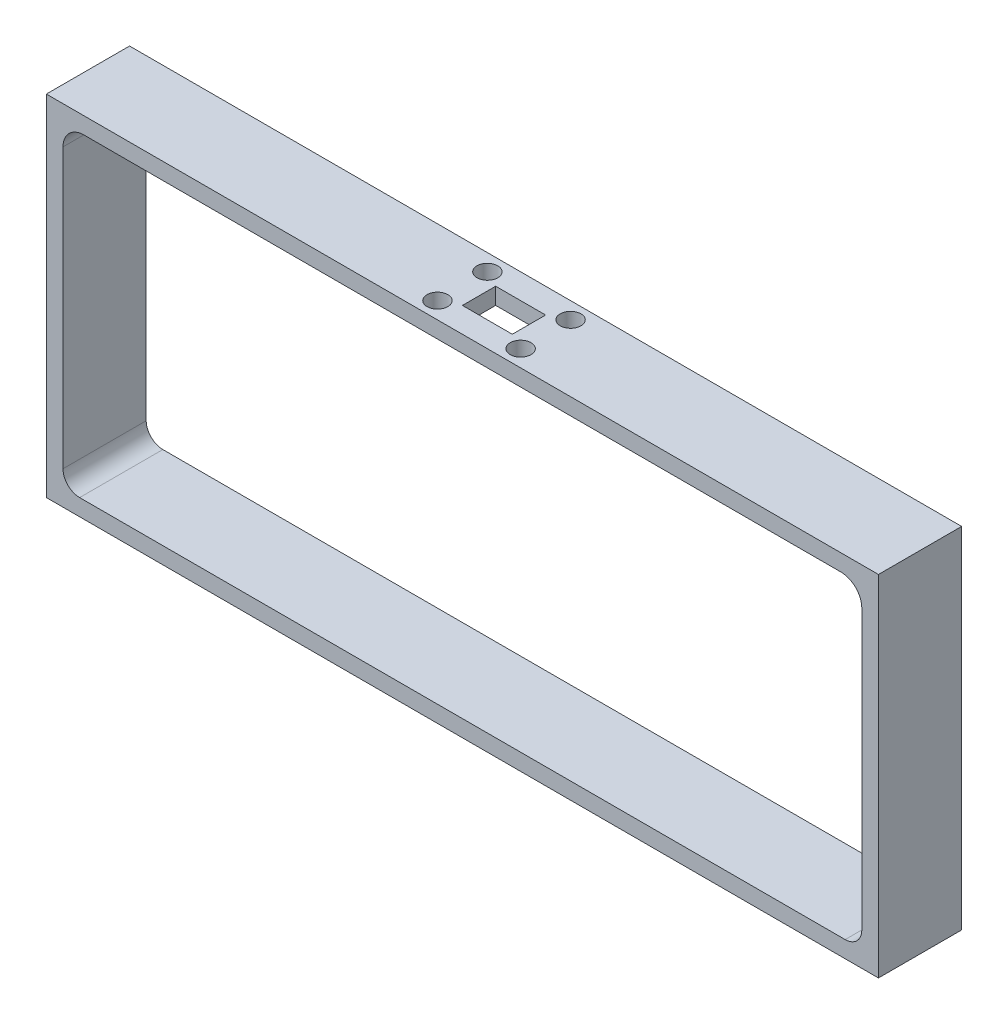
ISO-10303-21;
HEADER;
FILE_DESCRIPTION(('STEP AP214'),'2;1');
FILE_NAME('part.step','',(''),(''),'','','');
FILE_SCHEMA(('AUTOMOTIVE_DESIGN { 1 0 10303 214 1 1 1 1 }'));
ENDSEC;
DATA;
#1=APPLICATION_CONTEXT('core data for automotive mechanical design processes');
#2=APPLICATION_PROTOCOL_DEFINITION('international standard','automotive_design',2000,#1);
#3=PRODUCT_CONTEXT('',#1,'mechanical');
#4=PRODUCT('Part','Part','',(#3));
#5=PRODUCT_RELATED_PRODUCT_CATEGORY('part','',(#4));
#6=PRODUCT_DEFINITION_FORMATION('','',#4);
#7=PRODUCT_DEFINITION_CONTEXT('part definition',#1,'design');
#8=PRODUCT_DEFINITION('design','',#6,#7);
#9=PRODUCT_DEFINITION_SHAPE('','',#8);
#10=(LENGTH_UNIT() NAMED_UNIT(*) SI_UNIT(.MILLI.,.METRE.));
#11=(NAMED_UNIT(*) PLANE_ANGLE_UNIT() SI_UNIT($,.RADIAN.));
#12=(NAMED_UNIT(*) SI_UNIT($,.STERADIAN.) SOLID_ANGLE_UNIT());
#13=UNCERTAINTY_MEASURE_WITH_UNIT(LENGTH_MEASURE(1.E-05),#10,'distance_accuracy_value','');
#14=(GEOMETRIC_REPRESENTATION_CONTEXT(3) GLOBAL_UNCERTAINTY_ASSIGNED_CONTEXT((#13)) GLOBAL_UNIT_ASSIGNED_CONTEXT((#10,
#11,#12)) REPRESENTATION_CONTEXT('',''));
#15=CARTESIAN_POINT('',(0.,0.,0.));
#16=DIRECTION('',(0.,0.,1.));
#17=DIRECTION('',(1.,0.,0.));
#18=AXIS2_PLACEMENT_3D('',#15,#16,#17);
#19=CARTESIAN_POINT('',(-60.96,-50.8,6.35));
#20=DIRECTION('',(-1.,0.,0.));
#21=DIRECTION('',(0.,0.,1.));
#22=AXIS2_PLACEMENT_3D('',#19,#20,#21);
#23=PLANE('',#22);
#24=DIRECTION('',(0.,1.,0.));
#25=VECTOR('',#24,1.);
#26=CARTESIAN_POINT('',(-60.96,-50.8,-6.35));
#27=LINE('',#26,#25);
#28=CARTESIAN_POINT('',(-60.96,-45.72,-6.35));
#29=VERTEX_POINT('',#28);
#30=CARTESIAN_POINT('',(-60.96,-3.175,-6.35));
#31=VERTEX_POINT('',#30);
#32=EDGE_CURVE('E194',#29,#31,#27,.T.);
#33=ORIENTED_EDGE('',*,*,#32,.T.);
#34=DIRECTION('',(0.,0.,1.));
#35=VECTOR('',#34,1.);
#36=CARTESIAN_POINT('',(-60.96,-3.175,6.35));
#37=LINE('',#36,#35);
#38=CARTESIAN_POINT('',(-60.96,-3.175,6.35));
#39=VERTEX_POINT('',#38);
#40=EDGE_CURVE('E292',#31,#39,#37,.T.);
#41=ORIENTED_EDGE('',*,*,#40,.T.);
#42=DIRECTION('',(0.,1.,0.));
#43=VECTOR('',#42,1.);
#44=CARTESIAN_POINT('',(-60.96,-50.8,6.35));
#45=LINE('',#44,#43);
#46=CARTESIAN_POINT('',(-60.96,-45.72,6.35));
#47=VERTEX_POINT('',#46);
#48=EDGE_CURVE('E191',#47,#39,#45,.T.);
#49=ORIENTED_EDGE('',*,*,#48,.F.);
#50=DIRECTION('',(0.,0.,1.));
#51=VECTOR('',#50,1.);
#52=CARTESIAN_POINT('',(-60.96,-45.72,-6.35));
#53=LINE('',#52,#51);
#54=EDGE_CURVE('E275',#47,#29,#53,.F.);
#55=ORIENTED_EDGE('',*,*,#54,.T.);
#56=EDGE_LOOP('',(#33,#41,#49,#55));
#57=FACE_BOUND('',#56,.T.);
#58=ADVANCED_FACE('F37',(#57),#23,.F.);
#59=CARTESIAN_POINT('',(60.96,-50.8,-6.35));
#60=DIRECTION('',(1.,0.,0.));
#61=DIRECTION('',(0.,0.,-1.));
#62=AXIS2_PLACEMENT_3D('',#59,#60,#61);
#63=PLANE('',#62);
#64=DIRECTION('',(0.,1.,0.));
#65=VECTOR('',#64,1.);
#66=CARTESIAN_POINT('',(60.96,-50.8,6.35));
#67=LINE('',#66,#65);
#68=CARTESIAN_POINT('',(60.96,-45.72,6.35));
#69=VERTEX_POINT('',#68);
#70=CARTESIAN_POINT('',(60.96,-3.175,6.35));
#71=VERTEX_POINT('',#70);
#72=EDGE_CURVE('E180',#69,#71,#67,.T.);
#73=ORIENTED_EDGE('',*,*,#72,.T.);
#74=DIRECTION('',(0.,0.,-1.));
#75=VECTOR('',#74,1.);
#76=CARTESIAN_POINT('',(60.96,-3.175,-6.35));
#77=LINE('',#76,#75);
#78=CARTESIAN_POINT('',(60.96,-3.175,-6.35));
#79=VERTEX_POINT('',#78);
#80=EDGE_CURVE('E285',#71,#79,#77,.T.);
#81=ORIENTED_EDGE('',*,*,#80,.T.);
#82=DIRECTION('',(0.,1.,0.));
#83=VECTOR('',#82,1.);
#84=CARTESIAN_POINT('',(60.96,-50.8,-6.35));
#85=LINE('',#84,#83);
#86=CARTESIAN_POINT('',(60.96,-45.72,-6.35));
#87=VERTEX_POINT('',#86);
#88=EDGE_CURVE('E176',#87,#79,#85,.T.);
#89=ORIENTED_EDGE('',*,*,#88,.F.);
#90=DIRECTION('',(0.,0.,-1.));
#91=VECTOR('',#90,1.);
#92=CARTESIAN_POINT('',(60.96,-45.72,6.35));
#93=LINE('',#92,#91);
#94=EDGE_CURVE('E273',#87,#69,#93,.F.);
#95=ORIENTED_EDGE('',*,*,#94,.T.);
#96=EDGE_LOOP('',(#73,#81,#89,#95));
#97=FACE_BOUND('',#96,.T.);
#98=ADVANCED_FACE('F325',(#97),#63,.F.);
#99=CARTESIAN_POINT('',(0.,0.,0.));
#100=DIRECTION('',(0.,-1.,0.));
#101=DIRECTION('',(0.,0.,-1.));
#102=AXIS2_PLACEMENT_3D('',#99,#100,#101);
#103=PLANE('',#102);
#104=CARTESIAN_POINT('',(6.35,0.,3.81));
#105=DIRECTION('',(0.,1.,0.));
#106=DIRECTION('',(0.,0.,1.));
#107=AXIS2_PLACEMENT_3D('',#104,#105,#106);
#108=CIRCLE('',#107,1.5875);
#109=CARTESIAN_POINT('',(6.35,0.,5.3975));
#110=VERTEX_POINT('',#109);
#111=EDGE_CURVE('E200',#110,#110,#108,.T.);
#112=ORIENTED_EDGE('',*,*,#111,.T.);
#113=EDGE_LOOP('',(#112));
#114=FACE_BOUND('',#113,.T.);
#115=CARTESIAN_POINT('',(-6.35,0.,-3.81));
#116=DIRECTION('',(0.,1.,0.));
#117=DIRECTION('',(0.,0.,1.));
#118=AXIS2_PLACEMENT_3D('',#115,#116,#117);
#119=CIRCLE('',#118,1.5875);
#120=CARTESIAN_POINT('',(-6.35,0.,-2.2225));
#121=VERTEX_POINT('',#120);
#122=EDGE_CURVE('E212',#121,#121,#119,.T.);
#123=ORIENTED_EDGE('',*,*,#122,.T.);
#124=EDGE_LOOP('',(#123));
#125=FACE_BOUND('',#124,.T.);
#126=DIRECTION('',(-1.,0.,0.));
#127=VECTOR('',#126,1.);
#128=CARTESIAN_POINT('',(3.81,0.,-2.54));
#129=LINE('',#128,#127);
#130=CARTESIAN_POINT('',(3.81,0.,-2.54));
#131=VERTEX_POINT('',#130);
#132=CARTESIAN_POINT('',(-3.81,0.,-2.54));
#133=VERTEX_POINT('',#132);
#134=EDGE_CURVE('E224',#131,#133,#129,.T.);
#135=ORIENTED_EDGE('',*,*,#134,.T.);
#136=DIRECTION('',(0.,0.,1.));
#137=VECTOR('',#136,1.);
#138=CARTESIAN_POINT('',(-3.81,0.,2.54));
#139=LINE('',#138,#137);
#140=CARTESIAN_POINT('',(-3.81,0.,2.54));
#141=VERTEX_POINT('',#140);
#142=EDGE_CURVE('E218',#133,#141,#139,.T.);
#143=ORIENTED_EDGE('',*,*,#142,.T.);
#144=DIRECTION('',(1.,0.,0.));
#145=VECTOR('',#144,1.);
#146=CARTESIAN_POINT('',(3.81,0.,2.54));
#147=LINE('',#146,#145);
#148=CARTESIAN_POINT('',(3.81,0.,2.54));
#149=VERTEX_POINT('',#148);
#150=EDGE_CURVE('E234',#141,#149,#147,.T.);
#151=ORIENTED_EDGE('',*,*,#150,.T.);
#152=DIRECTION('',(0.,0.,-1.));
#153=VECTOR('',#152,1.);
#154=CARTESIAN_POINT('',(3.81,0.,2.54));
#155=LINE('',#154,#153);
#156=EDGE_CURVE('E237',#149,#131,#155,.T.);
#157=ORIENTED_EDGE('',*,*,#156,.T.);
#158=EDGE_LOOP('',(#135,#143,#151,#157));
#159=FACE_BOUND('',#158,.T.);
#160=CARTESIAN_POINT('',(6.35,0.,-3.81));
#161=DIRECTION('',(0.,1.,0.));
#162=DIRECTION('',(0.,0.,1.));
#163=AXIS2_PLACEMENT_3D('',#160,#161,#162);
#164=CIRCLE('',#163,1.5875);
#165=CARTESIAN_POINT('',(6.35,0.,-2.2225));
#166=VERTEX_POINT('',#165);
#167=EDGE_CURVE('E206',#166,#166,#164,.T.);
#168=ORIENTED_EDGE('',*,*,#167,.T.);
#169=EDGE_LOOP('',(#168));
#170=FACE_BOUND('',#169,.T.);
#171=CARTESIAN_POINT('',(-6.35,0.,3.81));
#172=DIRECTION('',(0.,1.,0.));
#173=DIRECTION('',(0.,0.,1.));
#174=AXIS2_PLACEMENT_3D('',#171,#172,#173);
#175=CIRCLE('',#174,1.5875);
#176=CARTESIAN_POINT('',(-6.35,0.,5.3975));
#177=VERTEX_POINT('',#176);
#178=EDGE_CURVE('E196',#177,#177,#175,.T.);
#179=ORIENTED_EDGE('',*,*,#178,.T.);
#180=EDGE_LOOP('',(#179));
#181=FACE_BOUND('',#180,.T.);
#182=DIRECTION('',(-1.,0.,0.));
#183=VECTOR('',#182,1.);
#184=CARTESIAN_POINT('',(12.7,0.,-6.35));
#185=LINE('',#184,#183);
#186=CARTESIAN_POINT('',(57.785,0.,-6.35));
#187=VERTEX_POINT('',#186);
#188=CARTESIAN_POINT('',(-57.785,0.,-6.35000000000001));
#189=VERTEX_POINT('',#188);
#190=EDGE_CURVE('E254',#187,#189,#185,.T.);
#191=ORIENTED_EDGE('',*,*,#190,.F.);
#192=DIRECTION('',(0.,0.,-1.));
#193=VECTOR('',#192,1.);
#194=CARTESIAN_POINT('',(57.785,0.,0.));
#195=LINE('',#194,#193);
#196=CARTESIAN_POINT('',(57.785,0.,6.35));
#197=VERTEX_POINT('',#196);
#198=EDGE_CURVE('E290',#187,#197,#195,.F.);
#199=ORIENTED_EDGE('',*,*,#198,.T.);
#200=DIRECTION('',(1.,0.,0.));
#201=VECTOR('',#200,1.);
#202=CARTESIAN_POINT('',(12.7,0.,6.35));
#203=LINE('',#202,#201);
#204=CARTESIAN_POINT('',(-57.785,0.,6.35));
#205=VERTEX_POINT('',#204);
#206=EDGE_CURVE('E251',#205,#197,#203,.T.);
#207=ORIENTED_EDGE('',*,*,#206,.F.);
#208=DIRECTION('',(0.,0.,1.));
#209=VECTOR('',#208,1.);
#210=CARTESIAN_POINT('',(-57.785,0.,0.));
#211=LINE('',#210,#209);
#212=EDGE_CURVE('E288',#205,#189,#211,.F.);
#213=ORIENTED_EDGE('',*,*,#212,.T.);
#214=EDGE_LOOP('',(#191,#199,#207,#213));
#215=FACE_BOUND('',#214,.T.);
#216=ADVANCED_FACE('F305',(#114,#125,#159,#170,#181,#215),#103,.T.);
#217=CARTESIAN_POINT('',(0.,2.54,0.));
#218=DIRECTION('',(0.,-1.,0.));
#219=DIRECTION('',(0.,0.,-1.));
#220=AXIS2_PLACEMENT_3D('',#217,#218,#219);
#221=PLANE('',#220);
#222=DIRECTION('',(-1.,0.,0.));
#223=VECTOR('',#222,1.);
#224=CARTESIAN_POINT('',(12.7,2.54,-6.35));
#225=LINE('',#224,#223);
#226=CARTESIAN_POINT('',(63.5,2.54,-6.35));
#227=VERTEX_POINT('',#226);
#228=CARTESIAN_POINT('',(-63.5,2.54,-6.35));
#229=VERTEX_POINT('',#228);
#230=EDGE_CURVE('E166',#227,#229,#225,.T.);
#231=ORIENTED_EDGE('',*,*,#230,.T.);
#232=DIRECTION('',(0.,0.,1.));
#233=VECTOR('',#232,1.);
#234=CARTESIAN_POINT('',(-63.5,2.54,6.35));
#235=LINE('',#234,#233);
#236=CARTESIAN_POINT('',(-63.5,2.54,6.35));
#237=VERTEX_POINT('',#236);
#238=EDGE_CURVE('E253',#229,#237,#235,.T.);
#239=ORIENTED_EDGE('',*,*,#238,.T.);
#240=DIRECTION('',(1.,0.,0.));
#241=VECTOR('',#240,1.);
#242=CARTESIAN_POINT('',(-63.5,2.54,6.35));
#243=LINE('',#242,#241);
#244=CARTESIAN_POINT('',(63.5,2.54,6.35));
#245=VERTEX_POINT('',#244);
#246=EDGE_CURVE('E256',#237,#245,#243,.T.);
#247=ORIENTED_EDGE('',*,*,#246,.T.);
#248=DIRECTION('',(0.,0.,-1.));
#249=VECTOR('',#248,1.);
#250=CARTESIAN_POINT('',(63.5,2.54,6.35));
#251=LINE('',#250,#249);
#252=EDGE_CURVE('E171',#245,#227,#251,.T.);
#253=ORIENTED_EDGE('',*,*,#252,.T.);
#254=EDGE_LOOP('',(#231,#239,#247,#253));
#255=FACE_BOUND('',#254,.T.);
#256=DIRECTION('',(0.,0.,1.));
#257=VECTOR('',#256,1.);
#258=CARTESIAN_POINT('',(-3.81,2.54,2.54));
#259=LINE('',#258,#257);
#260=CARTESIAN_POINT('',(-3.81,2.54,-2.54));
#261=VERTEX_POINT('',#260);
#262=CARTESIAN_POINT('',(-3.81,2.54,2.54));
#263=VERTEX_POINT('',#262);
#264=EDGE_CURVE('E221',#261,#263,#259,.T.);
#265=ORIENTED_EDGE('',*,*,#264,.F.);
#266=DIRECTION('',(-1.,0.,0.));
#267=VECTOR('',#266,1.);
#268=CARTESIAN_POINT('',(3.81,2.54,-2.54));
#269=LINE('',#268,#267);
#270=CARTESIAN_POINT('',(3.81,2.54,-2.54));
#271=VERTEX_POINT('',#270);
#272=EDGE_CURVE('E229',#271,#261,#269,.T.);
#273=ORIENTED_EDGE('',*,*,#272,.F.);
#274=DIRECTION('',(0.,0.,-1.));
#275=VECTOR('',#274,1.);
#276=CARTESIAN_POINT('',(3.81,2.54,2.54));
#277=LINE('',#276,#275);
#278=CARTESIAN_POINT('',(3.81,2.54,2.54));
#279=VERTEX_POINT('',#278);
#280=EDGE_CURVE('E226',#279,#271,#277,.T.);
#281=ORIENTED_EDGE('',*,*,#280,.F.);
#282=DIRECTION('',(1.,0.,0.));
#283=VECTOR('',#282,1.);
#284=CARTESIAN_POINT('',(3.81,2.54,2.54));
#285=LINE('',#284,#283);
#286=EDGE_CURVE('E223',#263,#279,#285,.T.);
#287=ORIENTED_EDGE('',*,*,#286,.F.);
#288=EDGE_LOOP('',(#265,#273,#281,#287));
#289=FACE_BOUND('',#288,.T.);
#290=CARTESIAN_POINT('',(-6.35,2.54,-3.81));
#291=DIRECTION('',(0.,1.,0.));
#292=DIRECTION('',(0.,0.,1.));
#293=AXIS2_PLACEMENT_3D('',#290,#291,#292);
#294=CIRCLE('',#293,1.5875);
#295=CARTESIAN_POINT('',(-6.35,2.54,-2.2225));
#296=VERTEX_POINT('',#295);
#297=EDGE_CURVE('E215',#296,#296,#294,.T.);
#298=ORIENTED_EDGE('',*,*,#297,.F.);
#299=EDGE_LOOP('',(#298));
#300=FACE_BOUND('',#299,.T.);
#301=CARTESIAN_POINT('',(6.35,2.54,-3.81));
#302=DIRECTION('',(0.,1.,0.));
#303=DIRECTION('',(0.,0.,1.));
#304=AXIS2_PLACEMENT_3D('',#301,#302,#303);
#305=CIRCLE('',#304,1.5875);
#306=CARTESIAN_POINT('',(6.35,2.54,-2.2225));
#307=VERTEX_POINT('',#306);
#308=EDGE_CURVE('E209',#307,#307,#305,.T.);
#309=ORIENTED_EDGE('',*,*,#308,.F.);
#310=EDGE_LOOP('',(#309));
#311=FACE_BOUND('',#310,.T.);
#312=CARTESIAN_POINT('',(6.35,2.54,3.81));
#313=DIRECTION('',(0.,1.,0.));
#314=DIRECTION('',(0.,0.,1.));
#315=AXIS2_PLACEMENT_3D('',#312,#313,#314);
#316=CIRCLE('',#315,1.5875);
#317=CARTESIAN_POINT('',(6.35,2.54,5.3975));
#318=VERTEX_POINT('',#317);
#319=EDGE_CURVE('E203',#318,#318,#316,.T.);
#320=ORIENTED_EDGE('',*,*,#319,.F.);
#321=EDGE_LOOP('',(#320));
#322=FACE_BOUND('',#321,.T.);
#323=CARTESIAN_POINT('',(-6.35,2.54,3.81));
#324=DIRECTION('',(0.,1.,0.));
#325=DIRECTION('',(0.,0.,1.));
#326=AXIS2_PLACEMENT_3D('',#323,#324,#325);
#327=CIRCLE('',#326,1.5875);
#328=CARTESIAN_POINT('',(-6.35,2.54,5.3975));
#329=VERTEX_POINT('',#328);
#330=EDGE_CURVE('E197',#329,#329,#327,.T.);
#331=ORIENTED_EDGE('',*,*,#330,.F.);
#332=EDGE_LOOP('',(#331));
#333=FACE_BOUND('',#332,.T.);
#334=ADVANCED_FACE('F375',(#255,#289,#300,#311,#322,#333),#221,.F.);
#335=CARTESIAN_POINT('',(-63.5,2.54,6.35));
#336=DIRECTION('',(1.,0.,0.));
#337=DIRECTION('',(0.,0.,-1.));
#338=AXIS2_PLACEMENT_3D('',#335,#336,#337);
#339=PLANE('',#338);
#340=DIRECTION('',(0.,0.,-1.));
#341=VECTOR('',#340,1.);
#342=CARTESIAN_POINT('',(-63.5,-50.8,-6.35));
#343=LINE('',#342,#341);
#344=CARTESIAN_POINT('',(-63.5,-50.8,6.35));
#345=VERTEX_POINT('',#344);
#346=CARTESIAN_POINT('',(-63.5,-50.8,-6.35));
#347=VERTEX_POINT('',#346);
#348=EDGE_CURVE('E158',#345,#347,#343,.T.);
#349=ORIENTED_EDGE('',*,*,#348,.F.);
#350=DIRECTION('',(0.,-1.,0.));
#351=VECTOR('',#350,1.);
#352=CARTESIAN_POINT('',(-63.5,2.54,6.35));
#353=LINE('',#352,#351);
#354=EDGE_CURVE('E263',#237,#345,#353,.T.);
#355=ORIENTED_EDGE('',*,*,#354,.F.);
#356=ORIENTED_EDGE('',*,*,#238,.F.);
#357=DIRECTION('',(0.,-1.,0.));
#358=VECTOR('',#357,1.);
#359=CARTESIAN_POINT('',(-63.5,2.54,-6.35));
#360=LINE('',#359,#358);
#361=EDGE_CURVE('E265',#229,#347,#360,.T.);
#362=ORIENTED_EDGE('',*,*,#361,.T.);
#363=EDGE_LOOP('',(#349,#355,#356,#362));
#364=FACE_BOUND('',#363,.T.);
#365=ADVANCED_FACE('F378',(#364),#339,.F.);
#366=CARTESIAN_POINT('',(12.7,2.54,6.35));
#367=DIRECTION('',(0.,0.,-1.));
#368=DIRECTION('',(-1.,0.,0.));
#369=AXIS2_PLACEMENT_3D('',#366,#367,#368);
#370=PLANE('',#369);
#371=ORIENTED_EDGE('',*,*,#354,.T.);
#372=DIRECTION('',(-1.,0.,0.));
#373=VECTOR('',#372,1.);
#374=CARTESIAN_POINT('',(-63.5,-50.8,6.35));
#375=LINE('',#374,#373);
#376=CARTESIAN_POINT('',(63.5,-50.8,6.35));
#377=VERTEX_POINT('',#376);
#378=EDGE_CURVE('E161',#377,#345,#375,.T.);
#379=ORIENTED_EDGE('',*,*,#378,.F.);
#380=DIRECTION('',(0.,-1.,0.));
#381=VECTOR('',#380,1.);
#382=CARTESIAN_POINT('',(63.5,2.54,6.35));
#383=LINE('',#382,#381);
#384=EDGE_CURVE('E170',#245,#377,#383,.T.);
#385=ORIENTED_EDGE('',*,*,#384,.F.);
#386=ORIENTED_EDGE('',*,*,#246,.F.);
#387=EDGE_LOOP('',(#371,#379,#385,#386));
#388=FACE_BOUND('',#387,.T.);
#389=DIRECTION('',(1.,0.,0.));
#390=VECTOR('',#389,1.);
#391=CARTESIAN_POINT('',(0.,-48.26,6.35));
#392=LINE('',#391,#390);
#393=CARTESIAN_POINT('',(-58.42,-48.26,6.35));
#394=VERTEX_POINT('',#393);
#395=CARTESIAN_POINT('',(58.42,-48.26,6.35));
#396=VERTEX_POINT('',#395);
#397=EDGE_CURVE('E177',#394,#396,#392,.T.);
#398=ORIENTED_EDGE('',*,*,#397,.F.);
#399=CARTESIAN_POINT('',(-58.42,-45.72,6.35));
#400=DIRECTION('',(0.,0.,-1.));
#401=DIRECTION('',(-1.,0.,0.));
#402=AXIS2_PLACEMENT_3D('',#399,#400,#401);
#403=CIRCLE('',#402,2.54);
#404=EDGE_CURVE('E281',#394,#47,#403,.T.);
#405=ORIENTED_EDGE('',*,*,#404,.T.);
#406=ORIENTED_EDGE('',*,*,#48,.T.);
#407=CARTESIAN_POINT('',(-57.785,-3.175,6.35));
#408=DIRECTION('',(0.,0.,-1.));
#409=DIRECTION('',(-1.,0.,0.));
#410=AXIS2_PLACEMENT_3D('',#407,#408,#409);
#411=CIRCLE('',#410,3.175);
#412=EDGE_CURVE('E45',#39,#205,#411,.T.);
#413=ORIENTED_EDGE('',*,*,#412,.T.);
#414=ORIENTED_EDGE('',*,*,#206,.T.);
#415=CARTESIAN_POINT('',(57.785,-3.175,6.35));
#416=DIRECTION('',(0.,0.,-1.));
#417=DIRECTION('',(-1.,0.,0.));
#418=AXIS2_PLACEMENT_3D('',#415,#416,#417);
#419=CIRCLE('',#418,3.175);
#420=EDGE_CURVE('E296',#197,#71,#419,.T.);
#421=ORIENTED_EDGE('',*,*,#420,.T.);
#422=ORIENTED_EDGE('',*,*,#72,.F.);
#423=CARTESIAN_POINT('',(58.42,-45.72,6.35));
#424=DIRECTION('',(0.,0.,-1.));
#425=DIRECTION('',(-1.,0.,0.));
#426=AXIS2_PLACEMENT_3D('',#423,#424,#425);
#427=CIRCLE('',#426,2.54);
#428=EDGE_CURVE('E279',#69,#396,#427,.T.);
#429=ORIENTED_EDGE('',*,*,#428,.T.);
#430=EDGE_LOOP('',(#398,#405,#406,#413,#414,#421,#422,#429));
#431=FACE_BOUND('',#430,.T.);
#432=ADVANCED_FACE('F300',(#388,#431),#370,.F.);
#433=CARTESIAN_POINT('',(63.5,2.54,6.35));
#434=DIRECTION('',(-1.,0.,0.));
#435=DIRECTION('',(0.,0.,1.));
#436=AXIS2_PLACEMENT_3D('',#433,#434,#435);
#437=PLANE('',#436);
#438=ORIENTED_EDGE('',*,*,#384,.T.);
#439=DIRECTION('',(0.,0.,1.));
#440=VECTOR('',#439,1.);
#441=CARTESIAN_POINT('',(63.5,-50.8,6.35));
#442=LINE('',#441,#440);
#443=CARTESIAN_POINT('',(63.5,-50.8,-6.35));
#444=VERTEX_POINT('',#443);
#445=EDGE_CURVE('E156',#444,#377,#442,.T.);
#446=ORIENTED_EDGE('',*,*,#445,.F.);
#447=DIRECTION('',(0.,-1.,0.));
#448=VECTOR('',#447,1.);
#449=CARTESIAN_POINT('',(63.5,2.54,-6.35));
#450=LINE('',#449,#448);
#451=EDGE_CURVE('E164',#227,#444,#450,.T.);
#452=ORIENTED_EDGE('',*,*,#451,.F.);
#453=ORIENTED_EDGE('',*,*,#252,.F.);
#454=EDGE_LOOP('',(#438,#446,#452,#453));
#455=FACE_BOUND('',#454,.T.);
#456=ADVANCED_FACE('F174',(#455),#437,.F.);
#457=CARTESIAN_POINT('',(12.7,2.54,-6.35));
#458=DIRECTION('',(0.,0.,1.));
#459=DIRECTION('',(1.,0.,0.));
#460=AXIS2_PLACEMENT_3D('',#457,#458,#459);
#461=PLANE('',#460);
#462=ORIENTED_EDGE('',*,*,#32,.F.);
#463=CARTESIAN_POINT('',(-58.42,-45.72,-6.35000000000001));
#464=DIRECTION('',(0.,0.,1.));
#465=DIRECTION('',(1.,0.,0.));
#466=AXIS2_PLACEMENT_3D('',#463,#464,#465);
#467=CIRCLE('',#466,2.54);
#468=CARTESIAN_POINT('',(-58.42,-48.26,-6.35));
#469=VERTEX_POINT('',#468);
#470=EDGE_CURVE('E283',#29,#469,#467,.T.);
#471=ORIENTED_EDGE('',*,*,#470,.T.);
#472=DIRECTION('',(1.,0.,0.));
#473=VECTOR('',#472,1.);
#474=CARTESIAN_POINT('',(0.,-48.26,-6.35));
#475=LINE('',#474,#473);
#476=CARTESIAN_POINT('',(58.42,-48.26,-6.35));
#477=VERTEX_POINT('',#476);
#478=EDGE_CURVE('E183',#469,#477,#475,.T.);
#479=ORIENTED_EDGE('',*,*,#478,.T.);
#480=CARTESIAN_POINT('',(58.42,-45.72,-6.35));
#481=DIRECTION('',(0.,0.,1.));
#482=DIRECTION('',(1.,0.,0.));
#483=AXIS2_PLACEMENT_3D('',#480,#481,#482);
#484=CIRCLE('',#483,2.54);
#485=EDGE_CURVE('E277',#477,#87,#484,.T.);
#486=ORIENTED_EDGE('',*,*,#485,.T.);
#487=ORIENTED_EDGE('',*,*,#88,.T.);
#488=CARTESIAN_POINT('',(57.785,-3.175,-6.35));
#489=DIRECTION('',(0.,0.,1.));
#490=DIRECTION('',(1.,0.,0.));
#491=AXIS2_PLACEMENT_3D('',#488,#489,#490);
#492=CIRCLE('',#491,3.175);
#493=EDGE_CURVE('E294',#79,#187,#492,.T.);
#494=ORIENTED_EDGE('',*,*,#493,.T.);
#495=ORIENTED_EDGE('',*,*,#190,.T.);
#496=CARTESIAN_POINT('',(-57.785,-3.175,-6.35000000000001));
#497=DIRECTION('',(0.,0.,1.));
#498=DIRECTION('',(1.,0.,0.));
#499=AXIS2_PLACEMENT_3D('',#496,#497,#498);
#500=CIRCLE('',#499,3.175);
#501=EDGE_CURVE('E11',#189,#31,#500,.T.);
#502=ORIENTED_EDGE('',*,*,#501,.T.);
#503=EDGE_LOOP('',(#462,#471,#479,#486,#487,#494,#495,#502));
#504=FACE_BOUND('',#503,.T.);
#505=DIRECTION('',(1.,0.,0.));
#506=VECTOR('',#505,1.);
#507=CARTESIAN_POINT('',(-60.96,-50.8,-6.35));
#508=LINE('',#507,#506);
#509=EDGE_CURVE('E151',#347,#444,#508,.T.);
#510=ORIENTED_EDGE('',*,*,#509,.F.);
#511=ORIENTED_EDGE('',*,*,#361,.F.);
#512=ORIENTED_EDGE('',*,*,#230,.F.);
#513=ORIENTED_EDGE('',*,*,#451,.T.);
#514=EDGE_LOOP('',(#510,#511,#512,#513));
#515=FACE_BOUND('',#514,.T.);
#516=ADVANCED_FACE('F165',(#504,#515),#461,.F.);
#517=CARTESIAN_POINT('',(-3.81,2.54,2.54));
#518=DIRECTION('',(1.,0.,0.));
#519=DIRECTION('',(0.,0.,-1.));
#520=AXIS2_PLACEMENT_3D('',#517,#518,#519);
#521=PLANE('',#520);
#522=ORIENTED_EDGE('',*,*,#142,.F.);
#523=DIRECTION('',(0.,-1.,0.));
#524=VECTOR('',#523,1.);
#525=CARTESIAN_POINT('',(-3.81,2.54,-2.54));
#526=LINE('',#525,#524);
#527=EDGE_CURVE('E231',#261,#133,#526,.T.);
#528=ORIENTED_EDGE('',*,*,#527,.F.);
#529=ORIENTED_EDGE('',*,*,#264,.T.);
#530=DIRECTION('',(0.,-1.,0.));
#531=VECTOR('',#530,1.);
#532=CARTESIAN_POINT('',(-3.81,2.54,2.54));
#533=LINE('',#532,#531);
#534=EDGE_CURVE('E248',#263,#141,#533,.T.);
#535=ORIENTED_EDGE('',*,*,#534,.T.);
#536=EDGE_LOOP('',(#522,#528,#529,#535));
#537=FACE_BOUND('',#536,.T.);
#538=ADVANCED_FACE('F370',(#537),#521,.T.);
#539=CARTESIAN_POINT('',(3.81,2.54,2.54));
#540=DIRECTION('',(0.,0.,-1.));
#541=DIRECTION('',(-1.,0.,0.));
#542=AXIS2_PLACEMENT_3D('',#539,#540,#541);
#543=PLANE('',#542);
#544=ORIENTED_EDGE('',*,*,#150,.F.);
#545=ORIENTED_EDGE('',*,*,#534,.F.);
#546=ORIENTED_EDGE('',*,*,#286,.T.);
#547=DIRECTION('',(0.,-1.,0.));
#548=VECTOR('',#547,1.);
#549=CARTESIAN_POINT('',(3.81,2.54,2.54));
#550=LINE('',#549,#548);
#551=EDGE_CURVE('E246',#279,#149,#550,.T.);
#552=ORIENTED_EDGE('',*,*,#551,.T.);
#553=EDGE_LOOP('',(#544,#545,#546,#552));
#554=FACE_BOUND('',#553,.T.);
#555=ADVANCED_FACE('F366',(#554),#543,.T.);
#556=CARTESIAN_POINT('',(3.81,2.54,2.54));
#557=DIRECTION('',(-1.,0.,0.));
#558=DIRECTION('',(0.,0.,1.));
#559=AXIS2_PLACEMENT_3D('',#556,#557,#558);
#560=PLANE('',#559);
#561=ORIENTED_EDGE('',*,*,#156,.F.);
#562=ORIENTED_EDGE('',*,*,#551,.F.);
#563=ORIENTED_EDGE('',*,*,#280,.T.);
#564=DIRECTION('',(0.,-1.,0.));
#565=VECTOR('',#564,1.);
#566=CARTESIAN_POINT('',(3.81,2.54,-2.54));
#567=LINE('',#566,#565);
#568=EDGE_CURVE('E244',#271,#131,#567,.T.);
#569=ORIENTED_EDGE('',*,*,#568,.T.);
#570=EDGE_LOOP('',(#561,#562,#563,#569));
#571=FACE_BOUND('',#570,.T.);
#572=ADVANCED_FACE('F362',(#571),#560,.T.);
#573=CARTESIAN_POINT('',(3.81,2.54,-2.54));
#574=DIRECTION('',(0.,0.,1.));
#575=DIRECTION('',(1.,0.,0.));
#576=AXIS2_PLACEMENT_3D('',#573,#574,#575);
#577=PLANE('',#576);
#578=ORIENTED_EDGE('',*,*,#134,.F.);
#579=ORIENTED_EDGE('',*,*,#568,.F.);
#580=ORIENTED_EDGE('',*,*,#272,.T.);
#581=ORIENTED_EDGE('',*,*,#527,.T.);
#582=EDGE_LOOP('',(#578,#579,#580,#581));
#583=FACE_BOUND('',#582,.T.);
#584=ADVANCED_FACE('F358',(#583),#577,.T.);
#585=CARTESIAN_POINT('',(-6.35,2.54,-3.81));
#586=DIRECTION('',(0.,-1.,0.));
#587=DIRECTION('',(0.,0.,-1.));
#588=AXIS2_PLACEMENT_3D('',#585,#586,#587);
#589=CYLINDRICAL_SURFACE('',#588,1.5875);
#590=ORIENTED_EDGE('',*,*,#297,.T.);
#591=EDGE_LOOP('',(#590));
#592=FACE_BOUND('',#591,.T.);
#593=ORIENTED_EDGE('',*,*,#122,.F.);
#594=EDGE_LOOP('',(#593));
#595=FACE_BOUND('',#594,.T.);
#596=ADVANCED_FACE('F354',(#592,#595),#589,.F.);
#597=CARTESIAN_POINT('',(6.35,2.54,-3.81));
#598=DIRECTION('',(0.,-1.,0.));
#599=DIRECTION('',(0.,0.,-1.));
#600=AXIS2_PLACEMENT_3D('',#597,#598,#599);
#601=CYLINDRICAL_SURFACE('',#600,1.5875);
#602=ORIENTED_EDGE('',*,*,#308,.T.);
#603=EDGE_LOOP('',(#602));
#604=FACE_BOUND('',#603,.T.);
#605=ORIENTED_EDGE('',*,*,#167,.F.);
#606=EDGE_LOOP('',(#605));
#607=FACE_BOUND('',#606,.T.);
#608=ADVANCED_FACE('F350',(#604,#607),#601,.F.);
#609=CARTESIAN_POINT('',(6.35,2.54,3.81));
#610=DIRECTION('',(0.,-1.,0.));
#611=DIRECTION('',(0.,0.,-1.));
#612=AXIS2_PLACEMENT_3D('',#609,#610,#611);
#613=CYLINDRICAL_SURFACE('',#612,1.5875);
#614=ORIENTED_EDGE('',*,*,#319,.T.);
#615=EDGE_LOOP('',(#614));
#616=FACE_BOUND('',#615,.T.);
#617=ORIENTED_EDGE('',*,*,#111,.F.);
#618=EDGE_LOOP('',(#617));
#619=FACE_BOUND('',#618,.T.);
#620=ADVANCED_FACE('F346',(#616,#619),#613,.F.);
#621=CARTESIAN_POINT('',(-6.35,2.54,3.81));
#622=DIRECTION('',(0.,-1.,0.));
#623=DIRECTION('',(0.,0.,-1.));
#624=AXIS2_PLACEMENT_3D('',#621,#622,#623);
#625=CYLINDRICAL_SURFACE('',#624,1.5875);
#626=ORIENTED_EDGE('',*,*,#330,.T.);
#627=EDGE_LOOP('',(#626));
#628=FACE_BOUND('',#627,.T.);
#629=ORIENTED_EDGE('',*,*,#178,.F.);
#630=EDGE_LOOP('',(#629));
#631=FACE_BOUND('',#630,.T.);
#632=ADVANCED_FACE('F343',(#628,#631),#625,.F.);
#633=CARTESIAN_POINT('',(0.,-50.8,0.));
#634=DIRECTION('',(0.,1.,0.));
#635=DIRECTION('',(0.,0.,1.));
#636=AXIS2_PLACEMENT_3D('',#633,#634,#635);
#637=PLANE('',#636);
#638=ORIENTED_EDGE('',*,*,#348,.T.);
#639=ORIENTED_EDGE('',*,*,#509,.T.);
#640=ORIENTED_EDGE('',*,*,#445,.T.);
#641=ORIENTED_EDGE('',*,*,#378,.T.);
#642=EDGE_LOOP('',(#638,#639,#640,#641));
#643=FACE_BOUND('',#642,.T.);
#644=ADVANCED_FACE('F153',(#643),#637,.F.);
#645=CARTESIAN_POINT('',(0.,-48.26,0.));
#646=DIRECTION('',(0.,-1.,0.));
#647=DIRECTION('',(0.,0.,-1.));
#648=AXIS2_PLACEMENT_3D('',#645,#646,#647);
#649=PLANE('',#648);
#650=ORIENTED_EDGE('',*,*,#397,.T.);
#651=DIRECTION('',(0.,0.,-1.));
#652=VECTOR('',#651,1.);
#653=CARTESIAN_POINT('',(58.42,-48.26,-6.35));
#654=LINE('',#653,#652);
#655=EDGE_CURVE('E270',#396,#477,#654,.T.);
#656=ORIENTED_EDGE('',*,*,#655,.T.);
#657=ORIENTED_EDGE('',*,*,#478,.F.);
#658=DIRECTION('',(0.,0.,1.));
#659=VECTOR('',#658,1.);
#660=CARTESIAN_POINT('',(-58.42,-48.26,6.35));
#661=LINE('',#660,#659);
#662=EDGE_CURVE('E267',#469,#394,#661,.T.);
#663=ORIENTED_EDGE('',*,*,#662,.T.);
#664=EDGE_LOOP('',(#650,#656,#657,#663));
#665=FACE_BOUND('',#664,.T.);
#666=ADVANCED_FACE('F316',(#665),#649,.F.);
#667=CARTESIAN_POINT('',(58.42,-45.72,0.));
#668=DIRECTION('',(0.,0.,1.));
#669=DIRECTION('',(1.,0.,0.));
#670=AXIS2_PLACEMENT_3D('',#667,#668,#669);
#671=CYLINDRICAL_SURFACE('',#670,2.54);
#672=ORIENTED_EDGE('',*,*,#428,.F.);
#673=ORIENTED_EDGE('',*,*,#94,.F.);
#674=ORIENTED_EDGE('',*,*,#485,.F.);
#675=ORIENTED_EDGE('',*,*,#655,.F.);
#676=EDGE_LOOP('',(#672,#673,#674,#675));
#677=FACE_BOUND('',#676,.T.);
#678=ADVANCED_FACE('F322',(#677),#671,.F.);
#679=CARTESIAN_POINT('',(-58.42,-45.72,0.));
#680=DIRECTION('',(0.,0.,-1.));
#681=DIRECTION('',(-1.,0.,0.));
#682=AXIS2_PLACEMENT_3D('',#679,#680,#681);
#683=CYLINDRICAL_SURFACE('',#682,2.54);
#684=ORIENTED_EDGE('',*,*,#470,.F.);
#685=ORIENTED_EDGE('',*,*,#54,.F.);
#686=ORIENTED_EDGE('',*,*,#404,.F.);
#687=ORIENTED_EDGE('',*,*,#662,.F.);
#688=EDGE_LOOP('',(#684,#685,#686,#687));
#689=FACE_BOUND('',#688,.T.);
#690=ADVANCED_FACE('F314',(#689),#683,.F.);
#691=CARTESIAN_POINT('',(57.785,-3.175,-6.35));
#692=DIRECTION('',(0.,0.,-1.));
#693=DIRECTION('',(-1.,0.,0.));
#694=AXIS2_PLACEMENT_3D('',#691,#692,#693);
#695=CYLINDRICAL_SURFACE('',#694,3.175);
#696=ORIENTED_EDGE('',*,*,#420,.F.);
#697=ORIENTED_EDGE('',*,*,#198,.F.);
#698=ORIENTED_EDGE('',*,*,#493,.F.);
#699=ORIENTED_EDGE('',*,*,#80,.F.);
#700=EDGE_LOOP('',(#696,#697,#698,#699));
#701=FACE_BOUND('',#700,.T.);
#702=ADVANCED_FACE('F328',(#701),#695,.F.);
#703=CARTESIAN_POINT('',(-57.785,-3.175,6.35));
#704=DIRECTION('',(0.,0.,1.));
#705=DIRECTION('',(1.,0.,0.));
#706=AXIS2_PLACEMENT_3D('',#703,#704,#705);
#707=CYLINDRICAL_SURFACE('',#706,3.175);
#708=ORIENTED_EDGE('',*,*,#501,.F.);
#709=ORIENTED_EDGE('',*,*,#212,.F.);
#710=ORIENTED_EDGE('',*,*,#412,.F.);
#711=ORIENTED_EDGE('',*,*,#40,.F.);
#712=EDGE_LOOP('',(#708,#709,#710,#711));
#713=FACE_BOUND('',#712,.T.);
#714=ADVANCED_FACE('F39',(#713),#707,.F.);
#715=CLOSED_SHELL('',(#58,#98,#216,#334,#365,#432,#456,#516,#538,#555,#572,#584,#596,#608,#620,
#632,#644,#666,#678,#690,#702,#714));
#716=MANIFOLD_SOLID_BREP('B2',#715);
#717=ADVANCED_BREP_SHAPE_REPRESENTATION('',(#18,#716),#14);
#718=SHAPE_DEFINITION_REPRESENTATION(#9,#717);
ENDSEC;
END-ISO-10303-21;
